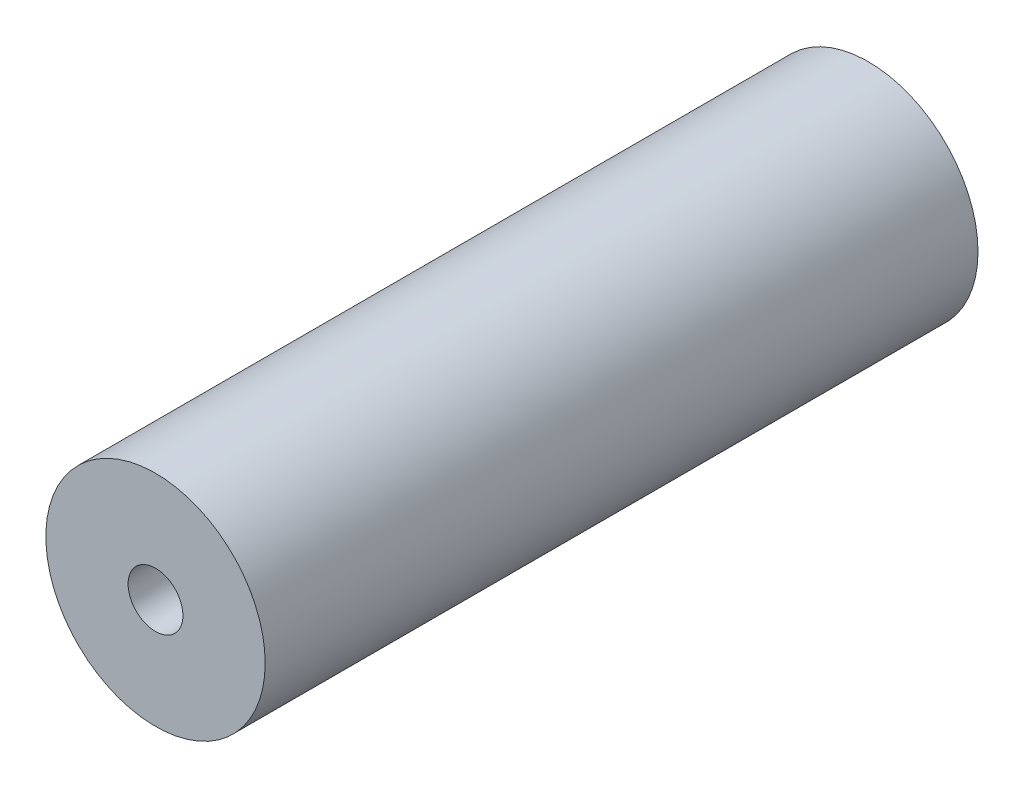
ISO-10303-21;
HEADER;
FILE_DESCRIPTION(('STEP AP214'),'2;1');
FILE_NAME('part.step','',(''),(''),'','','');
FILE_SCHEMA(('AUTOMOTIVE_DESIGN { 1 0 10303 214 1 1 1 1 }'));
ENDSEC;
DATA;
#1=APPLICATION_CONTEXT('core data for automotive mechanical design processes');
#2=APPLICATION_PROTOCOL_DEFINITION('international standard','automotive_design',2000,#1);
#3=PRODUCT_CONTEXT('',#1,'mechanical');
#4=PRODUCT('Part','Part','',(#3));
#5=PRODUCT_RELATED_PRODUCT_CATEGORY('part','',(#4));
#6=PRODUCT_DEFINITION_FORMATION('','',#4);
#7=PRODUCT_DEFINITION_CONTEXT('part definition',#1,'design');
#8=PRODUCT_DEFINITION('design','',#6,#7);
#9=PRODUCT_DEFINITION_SHAPE('','',#8);
#10=(LENGTH_UNIT() NAMED_UNIT(*) SI_UNIT(.MILLI.,.METRE.));
#11=(NAMED_UNIT(*) PLANE_ANGLE_UNIT() SI_UNIT($,.RADIAN.));
#12=(NAMED_UNIT(*) SI_UNIT($,.STERADIAN.) SOLID_ANGLE_UNIT());
#13=UNCERTAINTY_MEASURE_WITH_UNIT(LENGTH_MEASURE(1.E-05),#10,'distance_accuracy_value','');
#14=(GEOMETRIC_REPRESENTATION_CONTEXT(3) GLOBAL_UNCERTAINTY_ASSIGNED_CONTEXT((#13)) GLOBAL_UNIT_ASSIGNED_CONTEXT((#10,
#11,#12)) REPRESENTATION_CONTEXT('',''));
#15=CARTESIAN_POINT('',(0.,0.,0.));
#16=DIRECTION('',(0.,0.,1.));
#17=DIRECTION('',(1.,0.,0.));
#18=AXIS2_PLACEMENT_3D('',#15,#16,#17);
#19=CARTESIAN_POINT('',(0.,0.,165.1));
#20=DIRECTION('',(0.,0.,1.));
#21=DIRECTION('',(1.,0.,0.));
#22=AXIS2_PLACEMENT_3D('',#19,#20,#21);
#23=PLANE('',#22);
#24=CARTESIAN_POINT('',(0.,0.,165.1));
#25=DIRECTION('',(0.,0.,1.));
#26=DIRECTION('',(1.,0.,0.));
#27=AXIS2_PLACEMENT_3D('',#24,#25,#26);
#28=CIRCLE('',#27,25.4);
#29=CARTESIAN_POINT('',(25.4,0.,165.1));
#30=VERTEX_POINT('',#29);
#31=EDGE_CURVE('E10',#30,#30,#28,.T.);
#32=ORIENTED_EDGE('',*,*,#31,.T.);
#33=EDGE_LOOP('',(#32));
#34=FACE_BOUND('',#33,.T.);
#35=CARTESIAN_POINT('',(0.,0.,165.1));
#36=DIRECTION('',(0.,0.,1.));
#37=DIRECTION('',(1.,0.,0.));
#38=AXIS2_PLACEMENT_3D('',#35,#36,#37);
#39=CIRCLE('',#38,6.35);
#40=CARTESIAN_POINT('',(6.35,0.,165.1));
#41=VERTEX_POINT('',#40);
#42=EDGE_CURVE('E44',#41,#41,#39,.T.);
#43=ORIENTED_EDGE('',*,*,#42,.F.);
#44=EDGE_LOOP('',(#43));
#45=FACE_BOUND('',#44,.T.);
#46=ADVANCED_FACE('F33',(#34,#45),#23,.T.);
#47=CARTESIAN_POINT('',(0.,0.,0.));
#48=DIRECTION('',(0.,0.,1.));
#49=DIRECTION('',(1.,0.,0.));
#50=AXIS2_PLACEMENT_3D('',#47,#48,#49);
#51=PLANE('',#50);
#52=CARTESIAN_POINT('',(0.,0.,0.));
#53=DIRECTION('',(0.,0.,1.));
#54=DIRECTION('',(1.,0.,0.));
#55=AXIS2_PLACEMENT_3D('',#52,#53,#54);
#56=CIRCLE('',#55,25.4);
#57=CARTESIAN_POINT('',(25.4,0.,0.));
#58=VERTEX_POINT('',#57);
#59=EDGE_CURVE('E37',#58,#58,#56,.T.);
#60=ORIENTED_EDGE('',*,*,#59,.F.);
#61=EDGE_LOOP('',(#60));
#62=FACE_BOUND('',#61,.T.);
#63=CARTESIAN_POINT('',(0.,0.,0.));
#64=DIRECTION('',(0.,0.,1.));
#65=DIRECTION('',(1.,0.,0.));
#66=AXIS2_PLACEMENT_3D('',#63,#64,#65);
#67=CIRCLE('',#66,6.35);
#68=CARTESIAN_POINT('',(6.35,0.,0.));
#69=VERTEX_POINT('',#68);
#70=EDGE_CURVE('E46',#69,#69,#67,.T.);
#71=ORIENTED_EDGE('',*,*,#70,.T.);
#72=EDGE_LOOP('',(#71));
#73=FACE_BOUND('',#72,.T.);
#74=ADVANCED_FACE('F56',(#62,#73),#51,.F.);
#75=CARTESIAN_POINT('',(0.,0.,165.1));
#76=DIRECTION('',(0.,0.,-1.));
#77=DIRECTION('',(-1.,0.,0.));
#78=AXIS2_PLACEMENT_3D('',#75,#76,#77);
#79=CYLINDRICAL_SURFACE('',#78,25.4);
#80=ORIENTED_EDGE('',*,*,#31,.F.);
#81=EDGE_LOOP('',(#80));
#82=FACE_BOUND('',#81,.T.);
#83=ORIENTED_EDGE('',*,*,#59,.T.);
#84=EDGE_LOOP('',(#83));
#85=FACE_BOUND('',#84,.T.);
#86=ADVANCED_FACE('F35',(#82,#85),#79,.T.);
#87=CARTESIAN_POINT('',(0.,0.,165.1));
#88=DIRECTION('',(0.,0.,-1.));
#89=DIRECTION('',(-1.,0.,0.));
#90=AXIS2_PLACEMENT_3D('',#87,#88,#89);
#91=CYLINDRICAL_SURFACE('',#90,6.35);
#92=ORIENTED_EDGE('',*,*,#42,.T.);
#93=EDGE_LOOP('',(#92));
#94=FACE_BOUND('',#93,.T.);
#95=ORIENTED_EDGE('',*,*,#70,.F.);
#96=EDGE_LOOP('',(#95));
#97=FACE_BOUND('',#96,.T.);
#98=ADVANCED_FACE('F52',(#94,#97),#91,.F.);
#99=CLOSED_SHELL('',(#46,#74,#86,#98));
#100=MANIFOLD_SOLID_BREP('B2',#99);
#101=ADVANCED_BREP_SHAPE_REPRESENTATION('',(#18,#100),#14);
#102=SHAPE_DEFINITION_REPRESENTATION(#9,#101);
ENDSEC;
END-ISO-10303-21;
